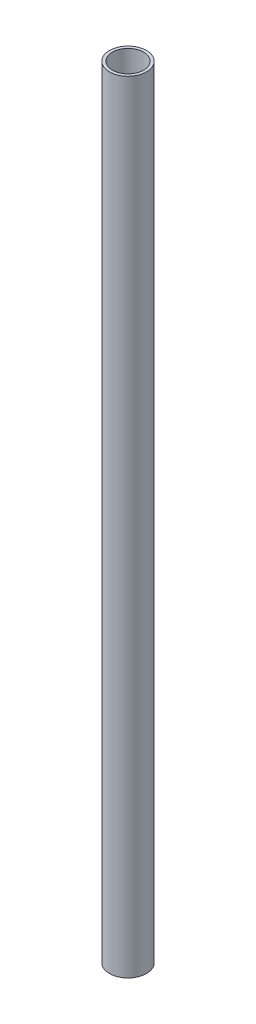
ISO-10303-21;
HEADER;
FILE_DESCRIPTION(('STEP AP214'),'2;1');
FILE_NAME('part.step','',(''),(''),'','','');
FILE_SCHEMA(('AUTOMOTIVE_DESIGN { 1 0 10303 214 1 1 1 1 }'));
ENDSEC;
DATA;
#1=APPLICATION_CONTEXT('core data for automotive mechanical design processes');
#2=APPLICATION_PROTOCOL_DEFINITION('international standard','automotive_design',2000,#1);
#3=PRODUCT_CONTEXT('',#1,'mechanical');
#4=PRODUCT('Part','Part','',(#3));
#5=PRODUCT_RELATED_PRODUCT_CATEGORY('part','',(#4));
#6=PRODUCT_DEFINITION_FORMATION('','',#4);
#7=PRODUCT_DEFINITION_CONTEXT('part definition',#1,'design');
#8=PRODUCT_DEFINITION('design','',#6,#7);
#9=PRODUCT_DEFINITION_SHAPE('','',#8);
#10=(LENGTH_UNIT() NAMED_UNIT(*) SI_UNIT(.MILLI.,.METRE.));
#11=(NAMED_UNIT(*) PLANE_ANGLE_UNIT() SI_UNIT($,.RADIAN.));
#12=(NAMED_UNIT(*) SI_UNIT($,.STERADIAN.) SOLID_ANGLE_UNIT());
#13=UNCERTAINTY_MEASURE_WITH_UNIT(LENGTH_MEASURE(1.E-05),#10,'distance_accuracy_value','');
#14=(GEOMETRIC_REPRESENTATION_CONTEXT(3) GLOBAL_UNCERTAINTY_ASSIGNED_CONTEXT((#13)) GLOBAL_UNIT_ASSIGNED_CONTEXT((#10,
#11,#12)) REPRESENTATION_CONTEXT('',''));
#15=CARTESIAN_POINT('',(0.,0.,0.));
#16=DIRECTION('',(0.,0.,1.));
#17=DIRECTION('',(1.,0.,0.));
#18=AXIS2_PLACEMENT_3D('',#15,#16,#17);
#19=CARTESIAN_POINT('',(0.,200.,0.));
#20=DIRECTION('',(0.,1.,0.));
#21=DIRECTION('',(0.,0.,1.));
#22=AXIS2_PLACEMENT_3D('',#19,#20,#21);
#23=PLANE('',#22);
#24=CARTESIAN_POINT('',(0.,200.,0.));
#25=DIRECTION('',(0.,1.,0.));
#26=DIRECTION('',(0.,0.,1.));
#27=AXIS2_PLACEMENT_3D('',#24,#25,#26);
#28=CIRCLE('',#27,4.75);
#29=CARTESIAN_POINT('',(0.,200.,4.75));
#30=VERTEX_POINT('',#29);
#31=EDGE_CURVE('E12',#30,#30,#28,.T.);
#32=ORIENTED_EDGE('',*,*,#31,.T.);
#33=EDGE_LOOP('',(#32));
#34=FACE_BOUND('',#33,.T.);
#35=CARTESIAN_POINT('',(0.,200.,0.));
#36=DIRECTION('',(0.,1.,0.));
#37=DIRECTION('',(0.,0.,1.));
#38=AXIS2_PLACEMENT_3D('',#35,#36,#37);
#39=CIRCLE('',#38,4.);
#40=CARTESIAN_POINT('',(0.,200.,4.));
#41=VERTEX_POINT('',#40);
#42=EDGE_CURVE('E59',#41,#41,#39,.T.);
#43=ORIENTED_EDGE('',*,*,#42,.F.);
#44=EDGE_LOOP('',(#43));
#45=FACE_BOUND('',#44,.T.);
#46=ADVANCED_FACE('F45',(#34,#45),#23,.T.);
#47=CARTESIAN_POINT('',(0.,0.,0.));
#48=DIRECTION('',(0.,1.,0.));
#49=DIRECTION('',(0.,0.,1.));
#50=AXIS2_PLACEMENT_3D('',#47,#48,#49);
#51=PLANE('',#50);
#52=CARTESIAN_POINT('',(0.,0.,0.));
#53=DIRECTION('',(0.,1.,0.));
#54=DIRECTION('',(0.,0.,1.));
#55=AXIS2_PLACEMENT_3D('',#52,#53,#54);
#56=CIRCLE('',#55,4.75);
#57=CARTESIAN_POINT('',(0.,0.,4.75));
#58=VERTEX_POINT('',#57);
#59=EDGE_CURVE('E49',#58,#58,#56,.T.);
#60=ORIENTED_EDGE('',*,*,#59,.F.);
#61=EDGE_LOOP('',(#60));
#62=FACE_BOUND('',#61,.T.);
#63=CARTESIAN_POINT('',(0.,0.,0.));
#64=DIRECTION('',(0.,1.,0.));
#65=DIRECTION('',(0.,0.,1.));
#66=AXIS2_PLACEMENT_3D('',#63,#64,#65);
#67=CIRCLE('',#66,4.);
#68=CARTESIAN_POINT('',(0.,0.,4.));
#69=VERTEX_POINT('',#68);
#70=EDGE_CURVE('E61',#69,#69,#67,.T.);
#71=ORIENTED_EDGE('',*,*,#70,.T.);
#72=EDGE_LOOP('',(#71));
#73=FACE_BOUND('',#72,.T.);
#74=ADVANCED_FACE('F72',(#62,#73),#51,.F.);
#75=CARTESIAN_POINT('',(0.,200.,0.));
#76=DIRECTION('',(0.,-1.,0.));
#77=DIRECTION('',(0.,0.,-1.));
#78=AXIS2_PLACEMENT_3D('',#75,#76,#77);
#79=CYLINDRICAL_SURFACE('',#78,4.75);
#80=ORIENTED_EDGE('',*,*,#31,.F.);
#81=EDGE_LOOP('',(#80));
#82=FACE_BOUND('',#81,.T.);
#83=ORIENTED_EDGE('',*,*,#59,.T.);
#84=EDGE_LOOP('',(#83));
#85=FACE_BOUND('',#84,.T.);
#86=ADVANCED_FACE('F47',(#82,#85),#79,.T.);
#87=CARTESIAN_POINT('',(0.,200.,0.));
#88=DIRECTION('',(0.,-1.,0.));
#89=DIRECTION('',(0.,0.,-1.));
#90=AXIS2_PLACEMENT_3D('',#87,#88,#89);
#91=CYLINDRICAL_SURFACE('',#90,4.);
#92=ORIENTED_EDGE('',*,*,#42,.T.);
#93=EDGE_LOOP('',(#92));
#94=FACE_BOUND('',#93,.T.);
#95=ORIENTED_EDGE('',*,*,#70,.F.);
#96=EDGE_LOOP('',(#95));
#97=FACE_BOUND('',#96,.T.);
#98=ADVANCED_FACE('F68',(#94,#97),#91,.F.);
#99=CLOSED_SHELL('',(#46,#74,#86,#98));
#100=MANIFOLD_SOLID_BREP('B2',#99);
#101=ADVANCED_BREP_SHAPE_REPRESENTATION('',(#18,#100),#14);
#102=SHAPE_DEFINITION_REPRESENTATION(#9,#101);
ENDSEC;
END-ISO-10303-21;
